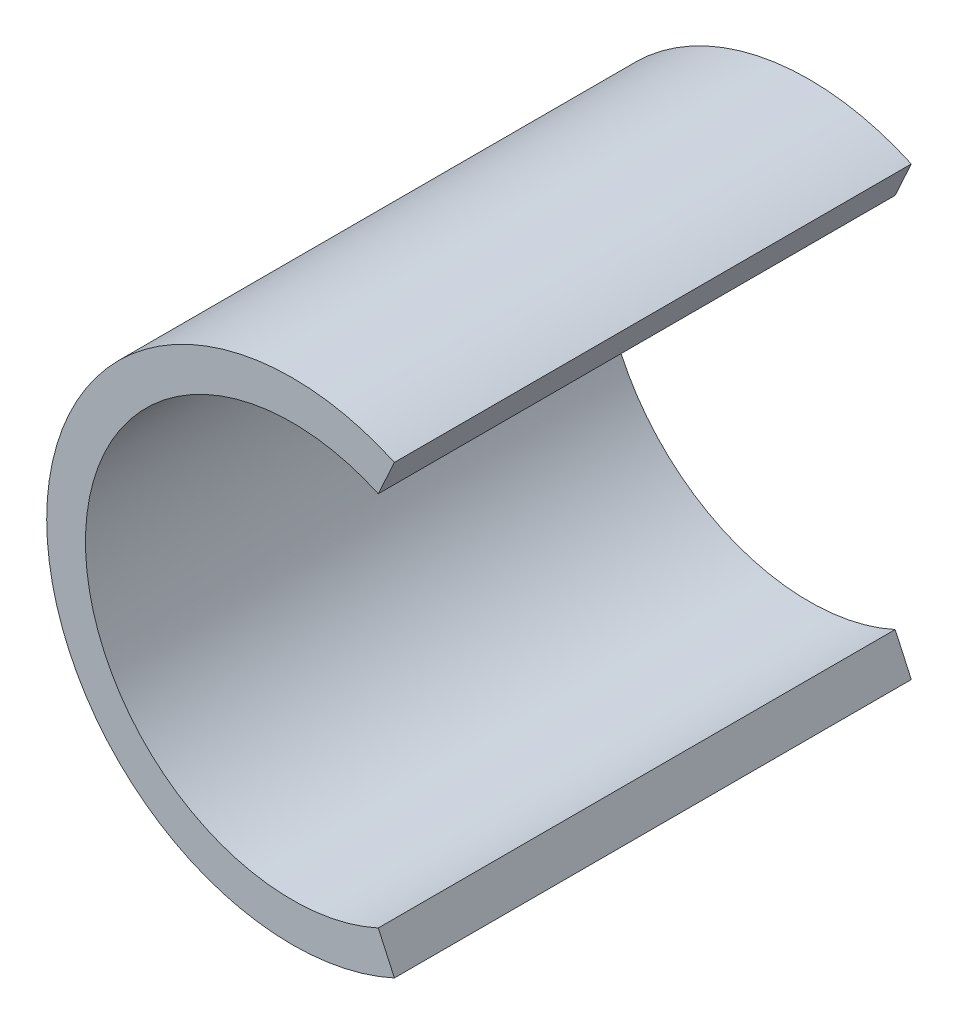
ISO-10303-21;
HEADER;
FILE_DESCRIPTION(('STEP AP214'),'2;1');
FILE_NAME('part.step','',(''),(''),'','','');
FILE_SCHEMA(('AUTOMOTIVE_DESIGN { 1 0 10303 214 1 1 1 1 }'));
ENDSEC;
DATA;
#1=APPLICATION_CONTEXT('core data for automotive mechanical design processes');
#2=APPLICATION_PROTOCOL_DEFINITION('international standard','automotive_design',2000,#1);
#3=PRODUCT_CONTEXT('',#1,'mechanical');
#4=PRODUCT('Part','Part','',(#3));
#5=PRODUCT_RELATED_PRODUCT_CATEGORY('part','',(#4));
#6=PRODUCT_DEFINITION_FORMATION('','',#4);
#7=PRODUCT_DEFINITION_CONTEXT('part definition',#1,'design');
#8=PRODUCT_DEFINITION('design','',#6,#7);
#9=PRODUCT_DEFINITION_SHAPE('','',#8);
#10=(LENGTH_UNIT() NAMED_UNIT(*) SI_UNIT(.MILLI.,.METRE.));
#11=(NAMED_UNIT(*) PLANE_ANGLE_UNIT() SI_UNIT($,.RADIAN.));
#12=(NAMED_UNIT(*) SI_UNIT($,.STERADIAN.) SOLID_ANGLE_UNIT());
#13=UNCERTAINTY_MEASURE_WITH_UNIT(LENGTH_MEASURE(1.E-05),#10,'distance_accuracy_value','');
#14=(GEOMETRIC_REPRESENTATION_CONTEXT(3) GLOBAL_UNCERTAINTY_ASSIGNED_CONTEXT((#13)) GLOBAL_UNIT_ASSIGNED_CONTEXT((#10,
#11,#12)) REPRESENTATION_CONTEXT('',''));
#15=CARTESIAN_POINT('',(0.,0.,0.));
#16=DIRECTION('',(0.,0.,1.));
#17=DIRECTION('',(1.,0.,0.));
#18=AXIS2_PLACEMENT_3D('',#15,#16,#17);
#19=CARTESIAN_POINT('',(0.,0.,10.));
#20=DIRECTION('',(0.,0.,1.));
#21=DIRECTION('',(1.,0.,0.));
#22=AXIS2_PLACEMENT_3D('',#19,#20,#21);
#23=PLANE('',#22);
#24=CARTESIAN_POINT('',(0.,0.,10.));
#25=DIRECTION('',(0.,0.,1.));
#26=DIRECTION('',(1.,0.,0.));
#27=AXIS2_PLACEMENT_3D('',#24,#25,#26);
#28=CIRCLE('',#27,4.);
#29=CARTESIAN_POINT('',(1.66450102978228,3.63722920941941,10.));
#30=VERTEX_POINT('',#29);
#31=CARTESIAN_POINT('',(1.66450102978228,-3.63722920941941,10.));
#32=VERTEX_POINT('',#31);
#33=EDGE_CURVE('E150',#30,#32,#28,.T.);
#34=ORIENTED_EDGE('',*,*,#33,.F.);
#35=DIRECTION('',(0.416125257445571,0.909307302354852,0.));
#36=VECTOR('',#35,1.);
#37=CARTESIAN_POINT('',(0.,0.,10.));
#38=LINE('',#37,#36);
#39=CARTESIAN_POINT('',(1.97659497286646,4.31920968618554,10.));
#40=VERTEX_POINT('',#39);
#41=EDGE_CURVE('E127',#30,#40,#38,.T.);
#42=ORIENTED_EDGE('',*,*,#41,.T.);
#43=CARTESIAN_POINT('',(0.,0.,10.));
#44=DIRECTION('',(0.,0.,1.));
#45=DIRECTION('',(1.,0.,0.));
#46=AXIS2_PLACEMENT_3D('',#43,#44,#45);
#47=CIRCLE('',#46,4.75);
#48=CARTESIAN_POINT('',(1.97659497286646,-4.31920968618554,10.));
#49=VERTEX_POINT('',#48);
#50=EDGE_CURVE('E156',#40,#49,#47,.T.);
#51=ORIENTED_EDGE('',*,*,#50,.T.);
#52=DIRECTION('',(0.416125257445571,-0.909307302354852,0.));
#53=VECTOR('',#52,1.);
#54=CARTESIAN_POINT('',(0.,0.,10.));
#55=LINE('',#54,#53);
#56=EDGE_CURVE('E134',#32,#49,#55,.T.);
#57=ORIENTED_EDGE('',*,*,#56,.F.);
#58=EDGE_LOOP('',(#34,#42,#51,#57));
#59=FACE_BOUND('',#58,.T.);
#60=ADVANCED_FACE('F36',(#59),#23,.T.);
#61=CARTESIAN_POINT('',(0.,0.,0.));
#62=DIRECTION('',(0.,0.,1.));
#63=DIRECTION('',(1.,0.,0.));
#64=AXIS2_PLACEMENT_3D('',#61,#62,#63);
#65=PLANE('',#64);
#66=DIRECTION('',(0.416125257445571,0.909307302354852,0.));
#67=VECTOR('',#66,1.);
#68=CARTESIAN_POINT('',(0.,0.,0.));
#69=LINE('',#68,#67);
#70=CARTESIAN_POINT('',(1.66450102978228,3.63722920941941,0.));
#71=VERTEX_POINT('',#70);
#72=CARTESIAN_POINT('',(1.97659497286646,4.31920968618554,0.));
#73=VERTEX_POINT('',#72);
#74=EDGE_CURVE('E132',#71,#73,#69,.T.);
#75=ORIENTED_EDGE('',*,*,#74,.F.);
#76=CARTESIAN_POINT('',(0.,0.,0.));
#77=DIRECTION('',(0.,0.,1.));
#78=DIRECTION('',(1.,0.,0.));
#79=AXIS2_PLACEMENT_3D('',#76,#77,#78);
#80=CIRCLE('',#79,4.);
#81=CARTESIAN_POINT('',(1.66450102978228,-3.63722920941941,0.));
#82=VERTEX_POINT('',#81);
#83=EDGE_CURVE('E142',#71,#82,#80,.T.);
#84=ORIENTED_EDGE('',*,*,#83,.T.);
#85=DIRECTION('',(0.416125257445571,-0.909307302354852,0.));
#86=VECTOR('',#85,1.);
#87=CARTESIAN_POINT('',(0.,0.,0.));
#88=LINE('',#87,#86);
#89=CARTESIAN_POINT('',(1.97659497286646,-4.31920968618554,0.));
#90=VERTEX_POINT('',#89);
#91=EDGE_CURVE('E59',#82,#90,#88,.T.);
#92=ORIENTED_EDGE('',*,*,#91,.T.);
#93=CARTESIAN_POINT('',(0.,0.,0.));
#94=DIRECTION('',(0.,0.,1.));
#95=DIRECTION('',(1.,0.,0.));
#96=AXIS2_PLACEMENT_3D('',#93,#94,#95);
#97=CIRCLE('',#96,4.75);
#98=EDGE_CURVE('E153',#73,#90,#97,.T.);
#99=ORIENTED_EDGE('',*,*,#98,.F.);
#100=EDGE_LOOP('',(#75,#84,#92,#99));
#101=FACE_BOUND('',#100,.T.);
#102=ADVANCED_FACE('F182',(#101),#65,.F.);
#103=CARTESIAN_POINT('',(0.,0.,10.));
#104=DIRECTION('',(0.,0.,-1.));
#105=DIRECTION('',(-1.,0.,0.));
#106=AXIS2_PLACEMENT_3D('',#103,#104,#105);
#107=CYLINDRICAL_SURFACE('',#106,4.75);
#108=DIRECTION('',(0.,0.,-1.));
#109=VECTOR('',#108,1.);
#110=CARTESIAN_POINT('',(-4.68367972325629,-0.790976769543761,10.));
#111=LINE('',#110,#109);
#112=CARTESIAN_POINT('',(-4.68367972325629,-0.790976769543761,9.20343436429505));
#113=VERTEX_POINT('',#112);
#114=CARTESIAN_POINT('',(-4.68367972325629,-0.790976769543761,1.0292679224051));
#115=VERTEX_POINT('',#114);
#116=EDGE_CURVE('E44',#113,#115,#111,.T.);
#117=ORIENTED_EDGE('',*,*,#116,.T.);
#118=CARTESIAN_POINT('',(0.,0.,1.0292679224051));
#119=DIRECTION('',(0.,0.,-1.));
#120=DIRECTION('',(-1.,0.,0.));
#121=AXIS2_PLACEMENT_3D('',#118,#119,#120);
#122=CIRCLE('',#121,4.75);
#123=CARTESIAN_POINT('',(-4.68361952008899,0.791333173221886,1.0292679224051));
#124=VERTEX_POINT('',#123);
#125=EDGE_CURVE('E11',#115,#124,#122,.T.);
#126=ORIENTED_EDGE('',*,*,#125,.T.);
#127=DIRECTION('',(0.,0.,-1.));
#128=VECTOR('',#127,1.);
#129=CARTESIAN_POINT('',(-4.68361952008899,0.791333173221886,10.));
#130=LINE('',#129,#128);
#131=CARTESIAN_POINT('',(-4.68361952008899,0.791333173221886,9.20343436429505));
#132=VERTEX_POINT('',#131);
#133=EDGE_CURVE('E104',#124,#132,#130,.F.);
#134=ORIENTED_EDGE('',*,*,#133,.T.);
#135=CARTESIAN_POINT('',(0.,0.,9.20343436429505));
#136=DIRECTION('',(0.,0.,1.));
#137=DIRECTION('',(1.,0.,0.));
#138=AXIS2_PLACEMENT_3D('',#135,#136,#137);
#139=CIRCLE('',#138,4.75);
#140=EDGE_CURVE('E162',#132,#113,#139,.T.);
#141=ORIENTED_EDGE('',*,*,#140,.T.);
#142=EDGE_LOOP('',(#117,#126,#134,#141));
#143=FACE_BOUND('',#142,.T.);
#144=DIRECTION('',(0.,0.,1.));
#145=VECTOR('',#144,1.);
#146=CARTESIAN_POINT('',(1.97659497286646,4.31920968618554,0.));
#147=LINE('',#146,#145);
#148=EDGE_CURVE('E140',#73,#40,#147,.T.);
#149=ORIENTED_EDGE('',*,*,#148,.F.);
#150=ORIENTED_EDGE('',*,*,#98,.T.);
#151=DIRECTION('',(0.,0.,1.));
#152=VECTOR('',#151,1.);
#153=CARTESIAN_POINT('',(1.97659497286646,-4.31920968618554,0.));
#154=LINE('',#153,#152);
#155=EDGE_CURVE('E143',#90,#49,#154,.T.);
#156=ORIENTED_EDGE('',*,*,#155,.T.);
#157=ORIENTED_EDGE('',*,*,#50,.F.);
#158=EDGE_LOOP('',(#149,#150,#156,#157));
#159=FACE_BOUND('',#158,.T.);
#160=ADVANCED_FACE('F38',(#143,#159),#107,.T.);
#161=CARTESIAN_POINT('',(0.,0.,10.));
#162=DIRECTION('',(0.,0.,-1.));
#163=DIRECTION('',(-1.,0.,0.));
#164=AXIS2_PLACEMENT_3D('',#161,#162,#163);
#165=CYLINDRICAL_SURFACE('',#164,4.);
#166=ORIENTED_EDGE('',*,*,#83,.F.);
#167=DIRECTION('',(0.,0.,1.));
#168=VECTOR('',#167,1.);
#169=CARTESIAN_POINT('',(1.66450102978228,3.63722920941941,0.));
#170=LINE('',#169,#168);
#171=EDGE_CURVE('E136',#71,#30,#170,.T.);
#172=ORIENTED_EDGE('',*,*,#171,.T.);
#173=ORIENTED_EDGE('',*,*,#33,.T.);
#174=DIRECTION('',(0.,0.,1.));
#175=VECTOR('',#174,1.);
#176=CARTESIAN_POINT('',(1.66450102978228,-3.63722920941941,0.));
#177=LINE('',#176,#175);
#178=EDGE_CURVE('E146',#82,#32,#177,.T.);
#179=ORIENTED_EDGE('',*,*,#178,.F.);
#180=EDGE_LOOP('',(#166,#172,#173,#179));
#181=FACE_BOUND('',#180,.T.);
#182=ADVANCED_FACE('F191',(#181),#165,.F.);
#183=CARTESIAN_POINT('',(0.,0.,0.));
#184=DIRECTION('',(-0.909307302354851,-0.416125257445571,0.));
#185=DIRECTION('',(0.416125257445571,-0.909307302354851,0.));
#186=AXIS2_PLACEMENT_3D('',#183,#184,#185);
#187=PLANE('',#186);
#188=ORIENTED_EDGE('',*,*,#56,.T.);
#189=ORIENTED_EDGE('',*,*,#155,.F.);
#190=ORIENTED_EDGE('',*,*,#91,.F.);
#191=ORIENTED_EDGE('',*,*,#178,.T.);
#192=EDGE_LOOP('',(#188,#189,#190,#191));
#193=FACE_BOUND('',#192,.T.);
#194=ADVANCED_FACE('F194',(#193),#187,.F.);
#195=CARTESIAN_POINT('',(0.,0.,0.));
#196=DIRECTION('',(0.909307302354851,-0.416125257445571,0.));
#197=DIRECTION('',(0.416125257445571,0.909307302354851,0.));
#198=AXIS2_PLACEMENT_3D('',#195,#196,#197);
#199=PLANE('',#198);
#200=ORIENTED_EDGE('',*,*,#41,.F.);
#201=ORIENTED_EDGE('',*,*,#171,.F.);
#202=ORIENTED_EDGE('',*,*,#74,.T.);
#203=ORIENTED_EDGE('',*,*,#148,.T.);
#204=EDGE_LOOP('',(#200,#201,#202,#203));
#205=FACE_BOUND('',#204,.T.);
#206=ADVANCED_FACE('F196',(#205),#199,.T.);
#207=CARTESIAN_POINT('',(-5.,-0.790976769543761,1.0292679224051));
#208=DIRECTION('',(0.,-1.,0.));
#209=DIRECTION('',(0.,0.,-1.));
#210=AXIS2_PLACEMENT_3D('',#207,#208,#209);
#211=PLANE('',#210);
#212=ORIENTED_EDGE('',*,*,#116,.F.);
#213=DIRECTION('',(1.,0.,0.));
#214=VECTOR('',#213,1.);
#215=CARTESIAN_POINT('',(-5.,-0.790976769543761,9.20343436429505));
#216=LINE('',#215,#214);
#217=CARTESIAN_POINT('',(-5.,-0.790976769543761,9.20343436429505));
#218=VERTEX_POINT('',#217);
#219=EDGE_CURVE('E128',#218,#113,#216,.T.);
#220=ORIENTED_EDGE('',*,*,#219,.F.);
#221=DIRECTION('',(0.,0.,-1.));
#222=VECTOR('',#221,1.);
#223=CARTESIAN_POINT('',(-5.,-0.790976769543761,1.0292679224051));
#224=LINE('',#223,#222);
#225=CARTESIAN_POINT('',(-5.,-0.790976769543761,1.0292679224051));
#226=VERTEX_POINT('',#225);
#227=EDGE_CURVE('E107',#218,#226,#224,.T.);
#228=ORIENTED_EDGE('',*,*,#227,.T.);
#229=DIRECTION('',(1.,0.,0.));
#230=VECTOR('',#229,1.);
#231=CARTESIAN_POINT('',(-5.,-0.790976769543761,1.0292679224051));
#232=LINE('',#231,#230);
#233=EDGE_CURVE('E121',#226,#115,#232,.T.);
#234=ORIENTED_EDGE('',*,*,#233,.T.);
#235=EDGE_LOOP('',(#212,#220,#228,#234));
#236=FACE_BOUND('',#235,.T.);
#237=ADVANCED_FACE('F168',(#236),#211,.T.);
#238=CARTESIAN_POINT('',(-5.,0.791333173221886,1.0292679224051));
#239=DIRECTION('',(0.,1.,0.));
#240=DIRECTION('',(0.,0.,1.));
#241=AXIS2_PLACEMENT_3D('',#238,#239,#240);
#242=PLANE('',#241);
#243=ORIENTED_EDGE('',*,*,#133,.F.);
#244=DIRECTION('',(1.,0.,0.));
#245=VECTOR('',#244,1.);
#246=CARTESIAN_POINT('',(-5.,0.791333173221886,1.0292679224051));
#247=LINE('',#246,#245);
#248=CARTESIAN_POINT('',(-5.,0.791333173221886,1.0292679224051));
#249=VERTEX_POINT('',#248);
#250=EDGE_CURVE('E99',#249,#124,#247,.T.);
#251=ORIENTED_EDGE('',*,*,#250,.F.);
#252=DIRECTION('',(0.,0.,1.));
#253=VECTOR('',#252,1.);
#254=CARTESIAN_POINT('',(-5.,0.791333173221886,1.0292679224051));
#255=LINE('',#254,#253);
#256=CARTESIAN_POINT('',(-5.,0.791333173221886,9.20343436429505));
#257=VERTEX_POINT('',#256);
#258=EDGE_CURVE('E102',#249,#257,#255,.T.);
#259=ORIENTED_EDGE('',*,*,#258,.T.);
#260=DIRECTION('',(1.,0.,0.));
#261=VECTOR('',#260,1.);
#262=CARTESIAN_POINT('',(-5.,0.791333173221886,9.20343436429505));
#263=LINE('',#262,#261);
#264=EDGE_CURVE('E51',#257,#132,#263,.T.);
#265=ORIENTED_EDGE('',*,*,#264,.T.);
#266=EDGE_LOOP('',(#243,#251,#259,#265));
#267=FACE_BOUND('',#266,.T.);
#268=ADVANCED_FACE('F101',(#267),#242,.T.);
#269=CARTESIAN_POINT('',(-5.,0.791333173221886,1.0292679224051));
#270=DIRECTION('',(0.,0.,-1.));
#271=DIRECTION('',(-1.,0.,0.));
#272=AXIS2_PLACEMENT_3D('',#269,#270,#271);
#273=PLANE('',#272);
#274=ORIENTED_EDGE('',*,*,#125,.F.);
#275=ORIENTED_EDGE('',*,*,#233,.F.);
#276=DIRECTION('',(0.,1.,0.));
#277=VECTOR('',#276,1.);
#278=CARTESIAN_POINT('',(-5.,0.791333173221886,1.0292679224051));
#279=LINE('',#278,#277);
#280=EDGE_CURVE('E114',#226,#249,#279,.T.);
#281=ORIENTED_EDGE('',*,*,#280,.T.);
#282=ORIENTED_EDGE('',*,*,#250,.T.);
#283=EDGE_LOOP('',(#274,#275,#281,#282));
#284=FACE_BOUND('',#283,.T.);
#285=ADVANCED_FACE('F119',(#284),#273,.T.);
#286=CARTESIAN_POINT('',(-5.,0.791333173221886,9.20343436429505));
#287=DIRECTION('',(0.,0.,1.));
#288=DIRECTION('',(1.,0.,0.));
#289=AXIS2_PLACEMENT_3D('',#286,#287,#288);
#290=PLANE('',#289);
#291=ORIENTED_EDGE('',*,*,#140,.F.);
#292=ORIENTED_EDGE('',*,*,#264,.F.);
#293=DIRECTION('',(0.,-1.,0.));
#294=VECTOR('',#293,1.);
#295=CARTESIAN_POINT('',(-5.,0.791333173221886,9.20343436429505));
#296=LINE('',#295,#294);
#297=EDGE_CURVE('E117',#257,#218,#296,.T.);
#298=ORIENTED_EDGE('',*,*,#297,.T.);
#299=ORIENTED_EDGE('',*,*,#219,.T.);
#300=EDGE_LOOP('',(#291,#292,#298,#299));
#301=FACE_BOUND('',#300,.T.);
#302=ADVANCED_FACE('F170',(#301),#290,.T.);
#303=CARTESIAN_POINT('',(-5.,0.,0.));
#304=DIRECTION('',(-1.,0.,0.));
#305=DIRECTION('',(0.,0.,1.));
#306=AXIS2_PLACEMENT_3D('',#303,#304,#305);
#307=PLANE('',#306);
#308=ORIENTED_EDGE('',*,*,#280,.F.);
#309=ORIENTED_EDGE('',*,*,#227,.F.);
#310=ORIENTED_EDGE('',*,*,#297,.F.);
#311=ORIENTED_EDGE('',*,*,#258,.F.);
#312=EDGE_LOOP('',(#308,#309,#310,#311));
#313=FACE_BOUND('',#312,.T.);
#314=ADVANCED_FACE('F112',(#313),#307,.T.);
#315=CLOSED_SHELL('',(#60,#102,#160,#182,#194,#206,#237,#268,#285,#302,#314));
#316=MANIFOLD_SOLID_BREP('B2',#315);
#317=ADVANCED_BREP_SHAPE_REPRESENTATION('',(#18,#316),#14);
#318=SHAPE_DEFINITION_REPRESENTATION(#9,#317);
ENDSEC;
END-ISO-10303-21;
